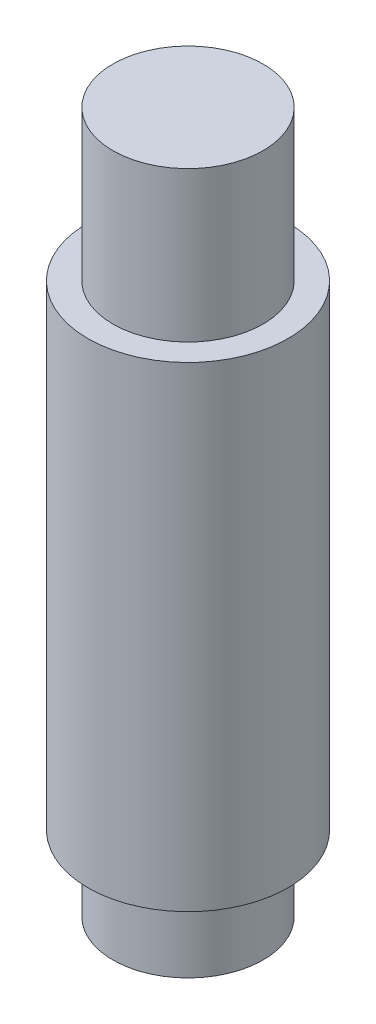
ISO-10303-21;
HEADER;
FILE_DESCRIPTION(('STEP AP214'),'2;1');
FILE_NAME('part.step','',(''),(''),'','','');
FILE_SCHEMA(('AUTOMOTIVE_DESIGN { 1 0 10303 214 1 1 1 1 }'));
ENDSEC;
DATA;
#1=APPLICATION_CONTEXT('core data for automotive mechanical design processes');
#2=APPLICATION_PROTOCOL_DEFINITION('international standard','automotive_design',2000,#1);
#3=PRODUCT_CONTEXT('',#1,'mechanical');
#4=PRODUCT('Part','Part','',(#3));
#5=PRODUCT_RELATED_PRODUCT_CATEGORY('part','',(#4));
#6=PRODUCT_DEFINITION_FORMATION('','',#4);
#7=PRODUCT_DEFINITION_CONTEXT('part definition',#1,'design');
#8=PRODUCT_DEFINITION('design','',#6,#7);
#9=PRODUCT_DEFINITION_SHAPE('','',#8);
#10=(LENGTH_UNIT() NAMED_UNIT(*) SI_UNIT(.MILLI.,.METRE.));
#11=(NAMED_UNIT(*) PLANE_ANGLE_UNIT() SI_UNIT($,.RADIAN.));
#12=(NAMED_UNIT(*) SI_UNIT($,.STERADIAN.) SOLID_ANGLE_UNIT());
#13=UNCERTAINTY_MEASURE_WITH_UNIT(LENGTH_MEASURE(1.E-05),#10,'distance_accuracy_value','');
#14=(GEOMETRIC_REPRESENTATION_CONTEXT(3) GLOBAL_UNCERTAINTY_ASSIGNED_CONTEXT((#13)) GLOBAL_UNIT_ASSIGNED_CONTEXT((#10,
#11,#12)) REPRESENTATION_CONTEXT('',''));
#15=CARTESIAN_POINT('',(0.,0.,0.));
#16=DIRECTION('',(0.,0.,1.));
#17=DIRECTION('',(1.,0.,0.));
#18=AXIS2_PLACEMENT_3D('',#15,#16,#17);
#19=CARTESIAN_POINT('',(0.,40.,0.));
#20=DIRECTION('',(0.,-1.,0.));
#21=DIRECTION('',(0.,0.,-1.));
#22=AXIS2_PLACEMENT_3D('',#19,#20,#21);
#23=CYLINDRICAL_SURFACE('',#22,20.);
#24=CARTESIAN_POINT('',(0.,40.,0.));
#25=DIRECTION('',(0.,1.,0.));
#26=DIRECTION('',(0.,0.,1.));
#27=AXIS2_PLACEMENT_3D('',#24,#25,#26);
#28=CIRCLE('',#27,20.);
#29=CARTESIAN_POINT('',(0.,40.,20.));
#30=VERTEX_POINT('',#29);
#31=EDGE_CURVE('E39',#30,#30,#28,.T.);
#32=ORIENTED_EDGE('',*,*,#31,.F.);
#33=EDGE_LOOP('',(#32));
#34=FACE_BOUND('',#33,.T.);
#35=CARTESIAN_POINT('',(0.,-55.,0.));
#36=DIRECTION('',(0.,-1.,0.));
#37=DIRECTION('',(0.,0.,-1.));
#38=AXIS2_PLACEMENT_3D('',#35,#36,#37);
#39=CIRCLE('',#38,20.);
#40=CARTESIAN_POINT('',(0.,-55.,-20.));
#41=VERTEX_POINT('',#40);
#42=EDGE_CURVE('E51',#41,#41,#39,.T.);
#43=ORIENTED_EDGE('',*,*,#42,.F.);
#44=EDGE_LOOP('',(#43));
#45=FACE_BOUND('',#44,.T.);
#46=ADVANCED_FACE('F32',(#34,#45),#23,.T.);
#47=CARTESIAN_POINT('',(0.,40.,0.));
#48=DIRECTION('',(0.,1.,0.));
#49=DIRECTION('',(0.,0.,1.));
#50=AXIS2_PLACEMENT_3D('',#47,#48,#49);
#51=PLANE('',#50);
#52=CARTESIAN_POINT('',(0.,40.,0.));
#53=DIRECTION('',(0.,1.,0.));
#54=DIRECTION('',(0.,0.,1.));
#55=AXIS2_PLACEMENT_3D('',#52,#53,#54);
#56=CIRCLE('',#55,15.);
#57=CARTESIAN_POINT('',(0.,40.,15.));
#58=VERTEX_POINT('',#57);
#59=EDGE_CURVE('E10',#58,#58,#56,.T.);
#60=ORIENTED_EDGE('',*,*,#59,.F.);
#61=EDGE_LOOP('',(#60));
#62=FACE_BOUND('',#61,.T.);
#63=ORIENTED_EDGE('',*,*,#31,.T.);
#64=EDGE_LOOP('',(#63));
#65=FACE_BOUND('',#64,.T.);
#66=ADVANCED_FACE('F76',(#62,#65),#51,.T.);
#67=CARTESIAN_POINT('',(0.,70.,0.));
#68=DIRECTION('',(0.,-1.,0.));
#69=DIRECTION('',(0.,0.,-1.));
#70=AXIS2_PLACEMENT_3D('',#67,#68,#69);
#71=CYLINDRICAL_SURFACE('',#70,15.);
#72=CARTESIAN_POINT('',(0.,70.,0.));
#73=DIRECTION('',(0.,1.,0.));
#74=DIRECTION('',(0.,0.,1.));
#75=AXIS2_PLACEMENT_3D('',#72,#73,#74);
#76=CIRCLE('',#75,15.);
#77=CARTESIAN_POINT('',(0.,70.,15.));
#78=VERTEX_POINT('',#77);
#79=EDGE_CURVE('E44',#78,#78,#76,.T.);
#80=ORIENTED_EDGE('',*,*,#79,.F.);
#81=EDGE_LOOP('',(#80));
#82=FACE_BOUND('',#81,.T.);
#83=ORIENTED_EDGE('',*,*,#59,.T.);
#84=EDGE_LOOP('',(#83));
#85=FACE_BOUND('',#84,.T.);
#86=ADVANCED_FACE('F72',(#82,#85),#71,.T.);
#87=CARTESIAN_POINT('',(0.,70.,0.));
#88=DIRECTION('',(0.,1.,0.));
#89=DIRECTION('',(0.,0.,1.));
#90=AXIS2_PLACEMENT_3D('',#87,#88,#89);
#91=PLANE('',#90);
#92=ORIENTED_EDGE('',*,*,#79,.T.);
#93=EDGE_LOOP('',(#92));
#94=FACE_BOUND('',#93,.T.);
#95=ADVANCED_FACE('F64',(#94),#91,.T.);
#96=CARTESIAN_POINT('',(0.,-55.,0.));
#97=DIRECTION('',(0.,-1.,0.));
#98=DIRECTION('',(0.,0.,-1.));
#99=AXIS2_PLACEMENT_3D('',#96,#97,#98);
#100=PLANE('',#99);
#101=CARTESIAN_POINT('',(0.,-55.,0.));
#102=DIRECTION('',(0.,-1.,0.));
#103=DIRECTION('',(0.,0.,-1.));
#104=AXIS2_PLACEMENT_3D('',#101,#102,#103);
#105=CIRCLE('',#104,15.);
#106=CARTESIAN_POINT('',(0.,-55.,-15.));
#107=VERTEX_POINT('',#106);
#108=EDGE_CURVE('E35',#107,#107,#105,.T.);
#109=ORIENTED_EDGE('',*,*,#108,.F.);
#110=EDGE_LOOP('',(#109));
#111=FACE_BOUND('',#110,.T.);
#112=ORIENTED_EDGE('',*,*,#42,.T.);
#113=EDGE_LOOP('',(#112));
#114=FACE_BOUND('',#113,.T.);
#115=ADVANCED_FACE('F61',(#111,#114),#100,.T.);
#116=CARTESIAN_POINT('',(0.,-70.,0.));
#117=DIRECTION('',(0.,-1.,0.));
#118=DIRECTION('',(0.,0.,-1.));
#119=AXIS2_PLACEMENT_3D('',#116,#117,#118);
#120=PLANE('',#119);
#121=CARTESIAN_POINT('',(0.,-70.,0.));
#122=DIRECTION('',(0.,-1.,0.));
#123=DIRECTION('',(0.,0.,-1.));
#124=AXIS2_PLACEMENT_3D('',#121,#122,#123);
#125=CIRCLE('',#124,15.);
#126=CARTESIAN_POINT('',(0.,-70.,-15.));
#127=VERTEX_POINT('',#126);
#128=EDGE_CURVE('E48',#127,#127,#125,.T.);
#129=ORIENTED_EDGE('',*,*,#128,.T.);
#130=EDGE_LOOP('',(#129));
#131=FACE_BOUND('',#130,.T.);
#132=ADVANCED_FACE('F63',(#131),#120,.T.);
#133=CARTESIAN_POINT('',(0.,-70.,0.));
#134=DIRECTION('',(0.,1.,0.));
#135=DIRECTION('',(0.,0.,1.));
#136=AXIS2_PLACEMENT_3D('',#133,#134,#135);
#137=CYLINDRICAL_SURFACE('',#136,15.);
#138=ORIENTED_EDGE('',*,*,#108,.T.);
#139=EDGE_LOOP('',(#138));
#140=FACE_BOUND('',#139,.T.);
#141=ORIENTED_EDGE('',*,*,#128,.F.);
#142=EDGE_LOOP('',(#141));
#143=FACE_BOUND('',#142,.T.);
#144=ADVANCED_FACE('F58',(#140,#143),#137,.T.);
#145=CLOSED_SHELL('',(#46,#66,#86,#95,#115,#132,#144));
#146=MANIFOLD_SOLID_BREP('B2',#145);
#147=ADVANCED_BREP_SHAPE_REPRESENTATION('',(#18,#146),#14);
#148=SHAPE_DEFINITION_REPRESENTATION(#9,#147);
ENDSEC;
END-ISO-10303-21;
